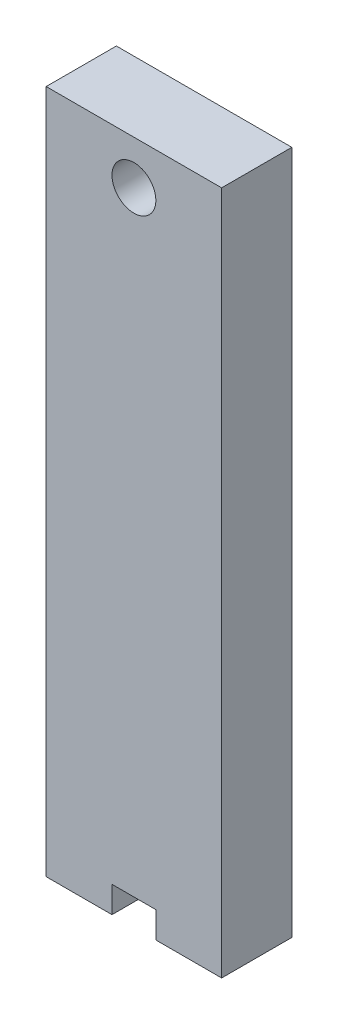
ISO-10303-21;
HEADER;
FILE_DESCRIPTION(('STEP AP214'),'2;1');
FILE_NAME('part.step','',(''),(''),'','','');
FILE_SCHEMA(('AUTOMOTIVE_DESIGN { 1 0 10303 214 1 1 1 1 }'));
ENDSEC;
DATA;
#1=APPLICATION_CONTEXT('core data for automotive mechanical design processes');
#2=APPLICATION_PROTOCOL_DEFINITION('international standard','automotive_design',2000,#1);
#3=PRODUCT_CONTEXT('',#1,'mechanical');
#4=PRODUCT('Part','Part','',(#3));
#5=PRODUCT_RELATED_PRODUCT_CATEGORY('part','',(#4));
#6=PRODUCT_DEFINITION_FORMATION('','',#4);
#7=PRODUCT_DEFINITION_CONTEXT('part definition',#1,'design');
#8=PRODUCT_DEFINITION('design','',#6,#7);
#9=PRODUCT_DEFINITION_SHAPE('','',#8);
#10=(LENGTH_UNIT() NAMED_UNIT(*) SI_UNIT(.MILLI.,.METRE.));
#11=(NAMED_UNIT(*) PLANE_ANGLE_UNIT() SI_UNIT($,.RADIAN.));
#12=(NAMED_UNIT(*) SI_UNIT($,.STERADIAN.) SOLID_ANGLE_UNIT());
#13=UNCERTAINTY_MEASURE_WITH_UNIT(LENGTH_MEASURE(1.E-05),#10,'distance_accuracy_value','');
#14=(GEOMETRIC_REPRESENTATION_CONTEXT(3) GLOBAL_UNCERTAINTY_ASSIGNED_CONTEXT((#13)) GLOBAL_UNIT_ASSIGNED_CONTEXT((#10,
#11,#12)) REPRESENTATION_CONTEXT('',''));
#15=CARTESIAN_POINT('',(0.,0.,0.));
#16=DIRECTION('',(0.,0.,1.));
#17=DIRECTION('',(1.,0.,0.));
#18=AXIS2_PLACEMENT_3D('',#15,#16,#17);
#19=CARTESIAN_POINT('',(0.,0.,0.));
#20=DIRECTION('',(0.,1.,0.));
#21=DIRECTION('',(0.,0.,1.));
#22=AXIS2_PLACEMENT_3D('',#19,#20,#21);
#23=PLANE('',#22);
#24=DIRECTION('',(0.,0.,-1.));
#25=VECTOR('',#24,1.);
#26=CARTESIAN_POINT('',(2.49999999999999,0.,-4.));
#27=LINE('',#26,#25);
#28=CARTESIAN_POINT('',(2.49999999999999,0.,4.));
#29=VERTEX_POINT('',#28);
#30=CARTESIAN_POINT('',(2.49999999999999,0.,2.));
#31=VERTEX_POINT('',#30);
#32=EDGE_CURVE('E53',#29,#31,#27,.T.);
#33=ORIENTED_EDGE('',*,*,#32,.F.);
#34=DIRECTION('',(1.,0.,0.));
#35=VECTOR('',#34,1.);
#36=CARTESIAN_POINT('',(-9.99999999999999,0.,4.));
#37=LINE('',#36,#35);
#38=CARTESIAN_POINT('',(-2.50000000000001,0.,4.));
#39=VERTEX_POINT('',#38);
#40=EDGE_CURVE('E318',#39,#29,#37,.T.);
#41=ORIENTED_EDGE('',*,*,#40,.F.);
#42=DIRECTION('',(0.,0.,1.));
#43=VECTOR('',#42,1.);
#44=CARTESIAN_POINT('',(-2.50000000000001,0.,4.));
#45=LINE('',#44,#43);
#46=CARTESIAN_POINT('',(-2.50000000000001,0.,2.));
#47=VERTEX_POINT('',#46);
#48=EDGE_CURVE('E11',#47,#39,#45,.T.);
#49=ORIENTED_EDGE('',*,*,#48,.F.);
#50=DIRECTION('',(1.,0.,0.));
#51=VECTOR('',#50,1.);
#52=CARTESIAN_POINT('',(-8.,0.,2.));
#53=LINE('',#52,#51);
#54=EDGE_CURVE('E301',#47,#31,#53,.T.);
#55=ORIENTED_EDGE('',*,*,#54,.T.);
#56=EDGE_LOOP('',(#33,#41,#49,#55));
#57=FACE_BOUND('',#56,.T.);
#58=ADVANCED_FACE('F36',(#57),#23,.F.);
#59=CARTESIAN_POINT('',(-8.,65.,-2.));
#60=DIRECTION('',(0.,0.,1.));
#61=DIRECTION('',(1.,0.,0.));
#62=AXIS2_PLACEMENT_3D('',#59,#60,#61);
#63=PLANE('',#62);
#64=DIRECTION('',(-1.,0.,0.));
#65=VECTOR('',#64,1.);
#66=CARTESIAN_POINT('',(8.,57.5,-2.));
#67=LINE('',#66,#65);
#68=CARTESIAN_POINT('',(8.,57.5,-2.));
#69=VERTEX_POINT('',#68);
#70=CARTESIAN_POINT('',(2.5,57.5,-2.));
#71=VERTEX_POINT('',#70);
#72=EDGE_CURVE('E238',#69,#71,#67,.T.);
#73=ORIENTED_EDGE('',*,*,#72,.T.);
#74=DIRECTION('',(0.,-1.,0.));
#75=VECTOR('',#74,1.);
#76=CARTESIAN_POINT('',(2.5,57.5,-2.));
#77=LINE('',#76,#75);
#78=CARTESIAN_POINT('',(2.49999999999999,0.,-2.));
#79=VERTEX_POINT('',#78);
#80=EDGE_CURVE('E271',#71,#79,#77,.T.);
#81=ORIENTED_EDGE('',*,*,#80,.T.);
#82=DIRECTION('',(-1.,0.,0.));
#83=VECTOR('',#82,1.);
#84=CARTESIAN_POINT('',(-8.,0.,-2.));
#85=LINE('',#84,#83);
#86=CARTESIAN_POINT('',(8.,0.,-2.));
#87=VERTEX_POINT('',#86);
#88=EDGE_CURVE('E295',#87,#79,#85,.T.);
#89=ORIENTED_EDGE('',*,*,#88,.F.);
#90=DIRECTION('',(0.,-1.,0.));
#91=VECTOR('',#90,1.);
#92=CARTESIAN_POINT('',(8.,65.,-2.));
#93=LINE('',#92,#91);
#94=EDGE_CURVE('E294',#69,#87,#93,.T.);
#95=ORIENTED_EDGE('',*,*,#94,.F.);
#96=EDGE_LOOP('',(#73,#81,#89,#95));
#97=FACE_BOUND('',#96,.T.);
#98=ADVANCED_FACE('F337',(#97),#63,.T.);
#99=DIRECTION('',(0.,1.,0.));
#100=VECTOR('',#99,1.);
#101=CARTESIAN_POINT('',(-2.5,57.5,-2.));
#102=LINE('',#101,#100);
#103=CARTESIAN_POINT('',(-2.50000000000001,0.,-2.));
#104=VERTEX_POINT('',#103);
#105=CARTESIAN_POINT('',(-2.5,57.5,-2.));
#106=VERTEX_POINT('',#105);
#107=EDGE_CURVE('E268',#104,#106,#102,.T.);
#108=ORIENTED_EDGE('',*,*,#107,.T.);
#109=DIRECTION('',(-1.,0.,0.));
#110=VECTOR('',#109,1.);
#111=CARTESIAN_POINT('',(-8.,57.5,-2.));
#112=LINE('',#111,#110);
#113=CARTESIAN_POINT('',(-8.,57.5,-2.));
#114=VERTEX_POINT('',#113);
#115=EDGE_CURVE('E263',#106,#114,#112,.T.);
#116=ORIENTED_EDGE('',*,*,#115,.T.);
#117=DIRECTION('',(0.,-1.,0.));
#118=VECTOR('',#117,1.);
#119=CARTESIAN_POINT('',(-8.,65.,-2.));
#120=LINE('',#119,#118);
#121=CARTESIAN_POINT('',(-8.,0.,-2.));
#122=VERTEX_POINT('',#121);
#123=EDGE_CURVE('E314',#114,#122,#120,.T.);
#124=ORIENTED_EDGE('',*,*,#123,.T.);
#125=EDGE_CURVE('E280',#104,#122,#85,.T.);
#126=ORIENTED_EDGE('',*,*,#125,.F.);
#127=EDGE_LOOP('',(#108,#116,#124,#126));
#128=FACE_BOUND('',#127,.T.);
#129=ADVANCED_FACE('F331',(#128),#63,.T.);
#130=CARTESIAN_POINT('',(10.,65.,-4.));
#131=DIRECTION('',(-1.,0.,0.));
#132=DIRECTION('',(0.,0.,1.));
#133=AXIS2_PLACEMENT_3D('',#130,#131,#132);
#134=PLANE('',#133);
#135=DIRECTION('',(0.,-1.,0.));
#136=VECTOR('',#135,1.);
#137=CARTESIAN_POINT('',(10.,65.,4.));
#138=LINE('',#137,#136);
#139=CARTESIAN_POINT('',(10.,75.,4.));
#140=VERTEX_POINT('',#139);
#141=CARTESIAN_POINT('',(10.,-3.,4.));
#142=VERTEX_POINT('',#141);
#143=EDGE_CURVE('E181',#140,#142,#138,.T.);
#144=ORIENTED_EDGE('',*,*,#143,.T.);
#145=DIRECTION('',(0.,0.,1.));
#146=VECTOR('',#145,1.);
#147=CARTESIAN_POINT('',(10.,-3.,-4.));
#148=LINE('',#147,#146);
#149=CARTESIAN_POINT('',(10.,-3.,-4.));
#150=VERTEX_POINT('',#149);
#151=EDGE_CURVE('E212',#150,#142,#148,.T.);
#152=ORIENTED_EDGE('',*,*,#151,.F.);
#153=DIRECTION('',(0.,-1.,0.));
#154=VECTOR('',#153,1.);
#155=CARTESIAN_POINT('',(10.,65.,-4.));
#156=LINE('',#155,#154);
#157=CARTESIAN_POINT('',(10.,75.,-4.));
#158=VERTEX_POINT('',#157);
#159=EDGE_CURVE('E40',#158,#150,#156,.T.);
#160=ORIENTED_EDGE('',*,*,#159,.F.);
#161=DIRECTION('',(0.,0.,-1.));
#162=VECTOR('',#161,1.);
#163=CARTESIAN_POINT('',(10.,75.,-4.));
#164=LINE('',#163,#162);
#165=EDGE_CURVE('E190',#140,#158,#164,.T.);
#166=ORIENTED_EDGE('',*,*,#165,.F.);
#167=EDGE_LOOP('',(#144,#152,#160,#166));
#168=FACE_BOUND('',#167,.T.);
#169=ADVANCED_FACE('F38',(#168),#134,.F.);
#170=CARTESIAN_POINT('',(-10.,65.,-4.));
#171=DIRECTION('',(0.,0.,1.));
#172=DIRECTION('',(1.,0.,0.));
#173=AXIS2_PLACEMENT_3D('',#170,#171,#172);
#174=PLANE('',#173);
#175=CARTESIAN_POINT('',(0.,70.,-4.));
#176=DIRECTION('',(0.,0.,1.));
#177=DIRECTION('',(1.,0.,0.));
#178=AXIS2_PLACEMENT_3D('',#175,#176,#177);
#179=CIRCLE('',#178,2.5);
#180=CARTESIAN_POINT('',(2.5,70.,-4.));
#181=VERTEX_POINT('',#180);
#182=EDGE_CURVE('E196',#181,#181,#179,.T.);
#183=ORIENTED_EDGE('',*,*,#182,.T.);
#184=EDGE_LOOP('',(#183));
#185=FACE_BOUND('',#184,.T.);
#186=ORIENTED_EDGE('',*,*,#159,.T.);
#187=DIRECTION('',(1.,0.,0.));
#188=VECTOR('',#187,1.);
#189=CARTESIAN_POINT('',(2.49999999999999,-3.,-4.));
#190=LINE('',#189,#188);
#191=CARTESIAN_POINT('',(2.49999999999999,-3.,-4.));
#192=VERTEX_POINT('',#191);
#193=EDGE_CURVE('E209',#192,#150,#190,.T.);
#194=ORIENTED_EDGE('',*,*,#193,.F.);
#195=DIRECTION('',(0.,-1.,0.));
#196=VECTOR('',#195,1.);
#197=CARTESIAN_POINT('',(2.5,57.5,-4.));
#198=LINE('',#197,#196);
#199=CARTESIAN_POINT('',(2.5,57.5,-4.));
#200=VERTEX_POINT('',#199);
#201=EDGE_CURVE('E248',#200,#192,#198,.T.);
#202=ORIENTED_EDGE('',*,*,#201,.F.);
#203=DIRECTION('',(-1.,0.,0.));
#204=VECTOR('',#203,1.);
#205=CARTESIAN_POINT('',(8.,57.5,-4.));
#206=LINE('',#205,#204);
#207=CARTESIAN_POINT('',(8.,57.5,-4.));
#208=VERTEX_POINT('',#207);
#209=EDGE_CURVE('E250',#208,#200,#206,.T.);
#210=ORIENTED_EDGE('',*,*,#209,.F.);
#211=DIRECTION('',(0.,-1.,0.));
#212=VECTOR('',#211,1.);
#213=CARTESIAN_POINT('',(8.,60.,-4.));
#214=LINE('',#213,#212);
#215=CARTESIAN_POINT('',(8.,60.,-4.));
#216=VERTEX_POINT('',#215);
#217=EDGE_CURVE('E234',#216,#208,#214,.T.);
#218=ORIENTED_EDGE('',*,*,#217,.F.);
#219=DIRECTION('',(1.,0.,0.));
#220=VECTOR('',#219,1.);
#221=CARTESIAN_POINT('',(-8.,60.,-4.));
#222=LINE('',#221,#220);
#223=CARTESIAN_POINT('',(-8.,60.,-4.));
#224=VERTEX_POINT('',#223);
#225=EDGE_CURVE('E235',#224,#216,#222,.T.);
#226=ORIENTED_EDGE('',*,*,#225,.F.);
#227=DIRECTION('',(0.,1.,0.));
#228=VECTOR('',#227,1.);
#229=CARTESIAN_POINT('',(-8.,60.,-4.));
#230=LINE('',#229,#228);
#231=CARTESIAN_POINT('',(-8.,57.5,-4.));
#232=VERTEX_POINT('',#231);
#233=EDGE_CURVE('E239',#232,#224,#230,.T.);
#234=ORIENTED_EDGE('',*,*,#233,.F.);
#235=DIRECTION('',(-1.,0.,0.));
#236=VECTOR('',#235,1.);
#237=CARTESIAN_POINT('',(-8.,57.5,-4.));
#238=LINE('',#237,#236);
#239=CARTESIAN_POINT('',(-2.5,57.5,-4.));
#240=VERTEX_POINT('',#239);
#241=EDGE_CURVE('E242',#240,#232,#238,.T.);
#242=ORIENTED_EDGE('',*,*,#241,.F.);
#243=DIRECTION('',(0.,1.,0.));
#244=VECTOR('',#243,1.);
#245=CARTESIAN_POINT('',(-2.5,57.5,-4.));
#246=LINE('',#245,#244);
#247=CARTESIAN_POINT('',(-2.50000000000001,-3.,-4.));
#248=VERTEX_POINT('',#247);
#249=EDGE_CURVE('E245',#248,#240,#246,.T.);
#250=ORIENTED_EDGE('',*,*,#249,.F.);
#251=DIRECTION('',(1.,0.,0.));
#252=VECTOR('',#251,1.);
#253=CARTESIAN_POINT('',(-9.99999999999999,-3.,-4.));
#254=LINE('',#253,#252);
#255=CARTESIAN_POINT('',(-9.99999999999999,-3.,-4.));
#256=VERTEX_POINT('',#255);
#257=EDGE_CURVE('E223',#256,#248,#254,.T.);
#258=ORIENTED_EDGE('',*,*,#257,.F.);
#259=DIRECTION('',(0.,-1.,0.));
#260=VECTOR('',#259,1.);
#261=CARTESIAN_POINT('',(-10.,65.,-4.));
#262=LINE('',#261,#260);
#263=CARTESIAN_POINT('',(-10.,75.,-4.));
#264=VERTEX_POINT('',#263);
#265=EDGE_CURVE('E180',#264,#256,#262,.T.);
#266=ORIENTED_EDGE('',*,*,#265,.F.);
#267=DIRECTION('',(-1.,0.,0.));
#268=VECTOR('',#267,1.);
#269=CARTESIAN_POINT('',(-10.,75.,-4.));
#270=LINE('',#269,#268);
#271=EDGE_CURVE('E195',#158,#264,#270,.T.);
#272=ORIENTED_EDGE('',*,*,#271,.F.);
#273=EDGE_LOOP('',(#186,#194,#202,#210,#218,#226,#234,#242,#250,#258,#266,#272));
#274=FACE_BOUND('',#273,.T.);
#275=ADVANCED_FACE('F323',(#185,#274),#174,.F.);
#276=CARTESIAN_POINT('',(-10.,65.,-4.));
#277=DIRECTION('',(1.,0.,0.));
#278=DIRECTION('',(0.,0.,-1.));
#279=AXIS2_PLACEMENT_3D('',#276,#277,#278);
#280=PLANE('',#279);
#281=ORIENTED_EDGE('',*,*,#265,.T.);
#282=DIRECTION('',(0.,0.,-1.));
#283=VECTOR('',#282,1.);
#284=CARTESIAN_POINT('',(-9.99999999999999,-3.,4.));
#285=LINE('',#284,#283);
#286=CARTESIAN_POINT('',(-9.99999999999999,-3.,4.));
#287=VERTEX_POINT('',#286);
#288=EDGE_CURVE('E176',#287,#256,#285,.T.);
#289=ORIENTED_EDGE('',*,*,#288,.F.);
#290=DIRECTION('',(0.,-1.,0.));
#291=VECTOR('',#290,1.);
#292=CARTESIAN_POINT('',(-9.99999999999999,65.,4.));
#293=LINE('',#292,#291);
#294=CARTESIAN_POINT('',(-10.,75.,4.));
#295=VERTEX_POINT('',#294);
#296=EDGE_CURVE('E170',#295,#287,#293,.T.);
#297=ORIENTED_EDGE('',*,*,#296,.F.);
#298=DIRECTION('',(0.,0.,1.));
#299=VECTOR('',#298,1.);
#300=CARTESIAN_POINT('',(-10.,75.,-4.));
#301=LINE('',#300,#299);
#302=EDGE_CURVE('E174',#264,#295,#301,.T.);
#303=ORIENTED_EDGE('',*,*,#302,.F.);
#304=EDGE_LOOP('',(#281,#289,#297,#303));
#305=FACE_BOUND('',#304,.T.);
#306=ADVANCED_FACE('F172',(#305),#280,.F.);
#307=CARTESIAN_POINT('',(-9.99999999999999,65.,4.));
#308=DIRECTION('',(0.,0.,-1.));
#309=DIRECTION('',(-1.,0.,0.));
#310=AXIS2_PLACEMENT_3D('',#307,#308,#309);
#311=PLANE('',#310);
#312=CARTESIAN_POINT('',(0.,70.,4.));
#313=DIRECTION('',(0.,0.,-1.));
#314=DIRECTION('',(-1.,0.,0.));
#315=AXIS2_PLACEMENT_3D('',#312,#313,#314);
#316=CIRCLE('',#315,2.5);
#317=CARTESIAN_POINT('',(-2.5,70.,4.));
#318=VERTEX_POINT('',#317);
#319=EDGE_CURVE('E199',#318,#318,#316,.T.);
#320=ORIENTED_EDGE('',*,*,#319,.T.);
#321=EDGE_LOOP('',(#320));
#322=FACE_BOUND('',#321,.T.);
#323=ORIENTED_EDGE('',*,*,#296,.T.);
#324=DIRECTION('',(-1.,0.,0.));
#325=VECTOR('',#324,1.);
#326=CARTESIAN_POINT('',(-9.99999999999999,-3.,4.));
#327=LINE('',#326,#325);
#328=CARTESIAN_POINT('',(-2.50000000000001,-3.,4.));
#329=VERTEX_POINT('',#328);
#330=EDGE_CURVE('E228',#329,#287,#327,.T.);
#331=ORIENTED_EDGE('',*,*,#330,.F.);
#332=DIRECTION('',(0.,1.,0.));
#333=VECTOR('',#332,1.);
#334=CARTESIAN_POINT('',(-2.50000000000001,-3.,4.));
#335=LINE('',#334,#333);
#336=EDGE_CURVE('E229',#329,#39,#335,.T.);
#337=ORIENTED_EDGE('',*,*,#336,.T.);
#338=ORIENTED_EDGE('',*,*,#40,.T.);
#339=DIRECTION('',(0.,1.,0.));
#340=VECTOR('',#339,1.);
#341=CARTESIAN_POINT('',(2.49999999999999,-3.,4.));
#342=LINE('',#341,#340);
#343=CARTESIAN_POINT('',(2.49999999999999,-3.,4.));
#344=VERTEX_POINT('',#343);
#345=EDGE_CURVE('E217',#344,#29,#342,.T.);
#346=ORIENTED_EDGE('',*,*,#345,.F.);
#347=DIRECTION('',(-1.,0.,0.));
#348=VECTOR('',#347,1.);
#349=CARTESIAN_POINT('',(2.49999999999999,-3.,4.));
#350=LINE('',#349,#348);
#351=EDGE_CURVE('E215',#142,#344,#350,.T.);
#352=ORIENTED_EDGE('',*,*,#351,.F.);
#353=ORIENTED_EDGE('',*,*,#143,.F.);
#354=DIRECTION('',(1.,0.,0.));
#355=VECTOR('',#354,1.);
#356=CARTESIAN_POINT('',(-10.,75.,4.));
#357=LINE('',#356,#355);
#358=EDGE_CURVE('E184',#295,#140,#357,.T.);
#359=ORIENTED_EDGE('',*,*,#358,.F.);
#360=EDGE_LOOP('',(#323,#331,#337,#338,#346,#352,#353,#359));
#361=FACE_BOUND('',#360,.T.);
#362=ADVANCED_FACE('F185',(#322,#361),#311,.F.);
#363=DIRECTION('',(1.,0.,0.));
#364=VECTOR('',#363,1.);
#365=CARTESIAN_POINT('',(-8.,60.,-2.));
#366=LINE('',#365,#364);
#367=CARTESIAN_POINT('',(-8.,60.,-2.));
#368=VERTEX_POINT('',#367);
#369=CARTESIAN_POINT('',(8.,60.,-2.));
#370=VERTEX_POINT('',#369);
#371=EDGE_CURVE('E258',#368,#370,#366,.T.);
#372=ORIENTED_EDGE('',*,*,#371,.T.);
#373=CARTESIAN_POINT('',(8.,65.,-2.));
#374=VERTEX_POINT('',#373);
#375=EDGE_CURVE('E307',#374,#370,#93,.T.);
#376=ORIENTED_EDGE('',*,*,#375,.F.);
#377=DIRECTION('',(-1.,0.,0.));
#378=VECTOR('',#377,1.);
#379=CARTESIAN_POINT('',(-8.,65.,-2.));
#380=LINE('',#379,#378);
#381=CARTESIAN_POINT('',(-8.,65.,-2.));
#382=VERTEX_POINT('',#381);
#383=EDGE_CURVE('E281',#374,#382,#380,.T.);
#384=ORIENTED_EDGE('',*,*,#383,.T.);
#385=EDGE_CURVE('E315',#382,#368,#120,.T.);
#386=ORIENTED_EDGE('',*,*,#385,.T.);
#387=EDGE_LOOP('',(#372,#376,#384,#386));
#388=FACE_BOUND('',#387,.T.);
#389=ADVANCED_FACE('F340',(#388),#63,.T.);
#390=CARTESIAN_POINT('',(-8.,65.,-2.));
#391=DIRECTION('',(1.,0.,0.));
#392=DIRECTION('',(0.,0.,-1.));
#393=AXIS2_PLACEMENT_3D('',#390,#391,#392);
#394=PLANE('',#393);
#395=DIRECTION('',(0.,0.,1.));
#396=VECTOR('',#395,1.);
#397=CARTESIAN_POINT('',(-8.,0.,-2.));
#398=LINE('',#397,#396);
#399=CARTESIAN_POINT('',(-8.,0.,2.));
#400=VERTEX_POINT('',#399);
#401=EDGE_CURVE('E298',#122,#400,#398,.T.);
#402=ORIENTED_EDGE('',*,*,#401,.F.);
#403=ORIENTED_EDGE('',*,*,#123,.F.);
#404=DIRECTION('',(0.,0.,-1.));
#405=VECTOR('',#404,1.);
#406=CARTESIAN_POINT('',(-8.,57.5,60.0966987850401));
#407=LINE('',#406,#405);
#408=EDGE_CURVE('E266',#114,#232,#407,.T.);
#409=ORIENTED_EDGE('',*,*,#408,.T.);
#410=ORIENTED_EDGE('',*,*,#233,.T.);
#411=DIRECTION('',(0.,0.,-1.));
#412=VECTOR('',#411,1.);
#413=CARTESIAN_POINT('',(-8.,60.,60.0966987850401));
#414=LINE('',#413,#412);
#415=EDGE_CURVE('E262',#368,#224,#414,.T.);
#416=ORIENTED_EDGE('',*,*,#415,.F.);
#417=ORIENTED_EDGE('',*,*,#385,.F.);
#418=DIRECTION('',(0.,0.,1.));
#419=VECTOR('',#418,1.);
#420=CARTESIAN_POINT('',(-8.,65.,-2.));
#421=LINE('',#420,#419);
#422=CARTESIAN_POINT('',(-8.,65.,2.));
#423=VERTEX_POINT('',#422);
#424=EDGE_CURVE('E284',#382,#423,#421,.T.);
#425=ORIENTED_EDGE('',*,*,#424,.T.);
#426=DIRECTION('',(0.,-1.,0.));
#427=VECTOR('',#426,1.);
#428=CARTESIAN_POINT('',(-8.,65.,2.));
#429=LINE('',#428,#427);
#430=EDGE_CURVE('E312',#423,#400,#429,.T.);
#431=ORIENTED_EDGE('',*,*,#430,.T.);
#432=EDGE_LOOP('',(#402,#403,#409,#410,#416,#417,#425,#431));
#433=FACE_BOUND('',#432,.T.);
#434=ADVANCED_FACE('F368',(#433),#394,.T.);
#435=CARTESIAN_POINT('',(-8.,65.,2.));
#436=DIRECTION('',(0.,0.,-1.));
#437=DIRECTION('',(-1.,0.,0.));
#438=AXIS2_PLACEMENT_3D('',#435,#436,#437);
#439=PLANE('',#438);
#440=EDGE_CURVE('E302',#400,#47,#53,.T.);
#441=ORIENTED_EDGE('',*,*,#440,.F.);
#442=ORIENTED_EDGE('',*,*,#430,.F.);
#443=DIRECTION('',(1.,0.,0.));
#444=VECTOR('',#443,1.);
#445=CARTESIAN_POINT('',(-8.,65.,2.));
#446=LINE('',#445,#444);
#447=CARTESIAN_POINT('',(8.,65.,2.));
#448=VERTEX_POINT('',#447);
#449=EDGE_CURVE('E288',#423,#448,#446,.T.);
#450=ORIENTED_EDGE('',*,*,#449,.T.);
#451=DIRECTION('',(0.,-1.,0.));
#452=VECTOR('',#451,1.);
#453=CARTESIAN_POINT('',(8.,65.,2.));
#454=LINE('',#453,#452);
#455=CARTESIAN_POINT('',(8.,0.,2.));
#456=VERTEX_POINT('',#455);
#457=EDGE_CURVE('E310',#448,#456,#454,.T.);
#458=ORIENTED_EDGE('',*,*,#457,.T.);
#459=DIRECTION('',(1.,0.,0.));
#460=VECTOR('',#459,1.);
#461=CARTESIAN_POINT('',(-8.,0.,2.));
#462=LINE('',#461,#460);
#463=EDGE_CURVE('E61',#31,#456,#462,.T.);
#464=ORIENTED_EDGE('',*,*,#463,.F.);
#465=ORIENTED_EDGE('',*,*,#54,.F.);
#466=EDGE_LOOP('',(#441,#442,#450,#458,#464,#465));
#467=FACE_BOUND('',#466,.T.);
#468=ADVANCED_FACE('F375',(#467),#439,.T.);
#469=CARTESIAN_POINT('',(8.,65.,-2.));
#470=DIRECTION('',(-1.,0.,0.));
#471=DIRECTION('',(0.,0.,1.));
#472=AXIS2_PLACEMENT_3D('',#469,#470,#471);
#473=PLANE('',#472);
#474=DIRECTION('',(0.,0.,-1.));
#475=VECTOR('',#474,1.);
#476=CARTESIAN_POINT('',(8.,0.,-2.));
#477=LINE('',#476,#475);
#478=EDGE_CURVE('E285',#456,#87,#477,.T.);
#479=ORIENTED_EDGE('',*,*,#478,.F.);
#480=ORIENTED_EDGE('',*,*,#457,.F.);
#481=DIRECTION('',(0.,0.,-1.));
#482=VECTOR('',#481,1.);
#483=CARTESIAN_POINT('',(8.,65.,-2.));
#484=LINE('',#483,#482);
#485=EDGE_CURVE('E291',#448,#374,#484,.T.);
#486=ORIENTED_EDGE('',*,*,#485,.T.);
#487=ORIENTED_EDGE('',*,*,#375,.T.);
#488=DIRECTION('',(0.,0.,-1.));
#489=VECTOR('',#488,1.);
#490=CARTESIAN_POINT('',(8.,60.,60.0966987850401));
#491=LINE('',#490,#489);
#492=EDGE_CURVE('E261',#370,#216,#491,.T.);
#493=ORIENTED_EDGE('',*,*,#492,.T.);
#494=ORIENTED_EDGE('',*,*,#217,.T.);
#495=DIRECTION('',(0.,0.,-1.));
#496=VECTOR('',#495,1.);
#497=CARTESIAN_POINT('',(8.,57.5,60.0966987850401));
#498=LINE('',#497,#496);
#499=EDGE_CURVE('E274',#69,#208,#498,.T.);
#500=ORIENTED_EDGE('',*,*,#499,.F.);
#501=ORIENTED_EDGE('',*,*,#94,.T.);
#502=EDGE_LOOP('',(#479,#480,#486,#487,#493,#494,#500,#501));
#503=FACE_BOUND('',#502,.T.);
#504=ADVANCED_FACE('F382',(#503),#473,.T.);
#505=CARTESIAN_POINT('',(8.,57.5,60.0966987850401));
#506=DIRECTION('',(0.,-1.,0.));
#507=DIRECTION('',(0.,0.,-1.));
#508=AXIS2_PLACEMENT_3D('',#505,#506,#507);
#509=PLANE('',#508);
#510=ORIENTED_EDGE('',*,*,#499,.T.);
#511=ORIENTED_EDGE('',*,*,#209,.T.);
#512=DIRECTION('',(0.,0.,-1.));
#513=VECTOR('',#512,1.);
#514=CARTESIAN_POINT('',(2.5,57.5,60.0966987850401));
#515=LINE('',#514,#513);
#516=EDGE_CURVE('E257',#71,#200,#515,.T.);
#517=ORIENTED_EDGE('',*,*,#516,.F.);
#518=ORIENTED_EDGE('',*,*,#72,.F.);
#519=EDGE_LOOP('',(#510,#511,#517,#518));
#520=FACE_BOUND('',#519,.T.);
#521=ADVANCED_FACE('F389',(#520),#509,.F.);
#522=CARTESIAN_POINT('',(2.5,57.5,60.0966987850401));
#523=DIRECTION('',(1.,0.,0.));
#524=DIRECTION('',(0.,1.,0.));
#525=AXIS2_PLACEMENT_3D('',#522,#523,#524);
#526=PLANE('',#525);
#527=ORIENTED_EDGE('',*,*,#516,.T.);
#528=ORIENTED_EDGE('',*,*,#201,.T.);
#529=DIRECTION('',(0.,0.,-1.));
#530=VECTOR('',#529,1.);
#531=CARTESIAN_POINT('',(2.49999999999999,-3.,-4.));
#532=LINE('',#531,#530);
#533=EDGE_CURVE('E206',#344,#192,#532,.T.);
#534=ORIENTED_EDGE('',*,*,#533,.F.);
#535=ORIENTED_EDGE('',*,*,#345,.T.);
#536=ORIENTED_EDGE('',*,*,#32,.T.);
#537=EDGE_CURVE('E205',#31,#79,#27,.T.);
#538=ORIENTED_EDGE('',*,*,#537,.T.);
#539=ORIENTED_EDGE('',*,*,#80,.F.);
#540=EDGE_LOOP('',(#527,#528,#534,#535,#536,#538,#539));
#541=FACE_BOUND('',#540,.T.);
#542=ADVANCED_FACE('F398',(#541),#526,.F.);
#543=CARTESIAN_POINT('',(-2.5,57.5,60.0966987850401));
#544=DIRECTION('',(-1.,0.,0.));
#545=DIRECTION('',(0.,-1.,0.));
#546=AXIS2_PLACEMENT_3D('',#543,#544,#545);
#547=PLANE('',#546);
#548=ORIENTED_EDGE('',*,*,#107,.F.);
#549=EDGE_CURVE('E46',#104,#47,#45,.T.);
#550=ORIENTED_EDGE('',*,*,#549,.T.);
#551=ORIENTED_EDGE('',*,*,#48,.T.);
#552=ORIENTED_EDGE('',*,*,#336,.F.);
#553=DIRECTION('',(0.,0.,1.));
#554=VECTOR('',#553,1.);
#555=CARTESIAN_POINT('',(-2.50000000000001,-3.,4.));
#556=LINE('',#555,#554);
#557=EDGE_CURVE('E226',#248,#329,#556,.T.);
#558=ORIENTED_EDGE('',*,*,#557,.F.);
#559=ORIENTED_EDGE('',*,*,#249,.T.);
#560=DIRECTION('',(0.,0.,-1.));
#561=VECTOR('',#560,1.);
#562=CARTESIAN_POINT('',(-2.5,57.5,60.0966987850401));
#563=LINE('',#562,#561);
#564=EDGE_CURVE('E267',#106,#240,#563,.T.);
#565=ORIENTED_EDGE('',*,*,#564,.F.);
#566=EDGE_LOOP('',(#548,#550,#551,#552,#558,#559,#565));
#567=FACE_BOUND('',#566,.T.);
#568=ADVANCED_FACE('F407',(#567),#547,.F.);
#569=CARTESIAN_POINT('',(-8.,57.5,60.0966987850401));
#570=DIRECTION('',(0.,-1.,0.));
#571=DIRECTION('',(0.,0.,-1.));
#572=AXIS2_PLACEMENT_3D('',#569,#570,#571);
#573=PLANE('',#572);
#574=ORIENTED_EDGE('',*,*,#564,.T.);
#575=ORIENTED_EDGE('',*,*,#241,.T.);
#576=ORIENTED_EDGE('',*,*,#408,.F.);
#577=ORIENTED_EDGE('',*,*,#115,.F.);
#578=EDGE_LOOP('',(#574,#575,#576,#577));
#579=FACE_BOUND('',#578,.T.);
#580=ADVANCED_FACE('F416',(#579),#573,.F.);
#581=CARTESIAN_POINT('',(-8.,60.,60.0966987850401));
#582=DIRECTION('',(0.,1.,0.));
#583=DIRECTION('',(0.,0.,1.));
#584=AXIS2_PLACEMENT_3D('',#581,#582,#583);
#585=PLANE('',#584);
#586=ORIENTED_EDGE('',*,*,#415,.T.);
#587=ORIENTED_EDGE('',*,*,#225,.T.);
#588=ORIENTED_EDGE('',*,*,#492,.F.);
#589=ORIENTED_EDGE('',*,*,#371,.F.);
#590=EDGE_LOOP('',(#586,#587,#588,#589));
#591=FACE_BOUND('',#590,.T.);
#592=ADVANCED_FACE('F424',(#591),#585,.F.);
#593=CARTESIAN_POINT('',(0.,0.,0.));
#594=DIRECTION('',(0.,-1.,0.));
#595=DIRECTION('',(0.,0.,-1.));
#596=AXIS2_PLACEMENT_3D('',#593,#594,#595);
#597=PLANE('',#596);
#598=ORIENTED_EDGE('',*,*,#549,.F.);
#599=ORIENTED_EDGE('',*,*,#125,.T.);
#600=ORIENTED_EDGE('',*,*,#401,.T.);
#601=ORIENTED_EDGE('',*,*,#440,.T.);
#602=EDGE_LOOP('',(#598,#599,#600,#601));
#603=FACE_BOUND('',#602,.T.);
#604=ADVANCED_FACE('F432',(#603),#597,.F.);
#605=CARTESIAN_POINT('',(0.,-3.,0.));
#606=DIRECTION('',(0.,-1.,0.));
#607=DIRECTION('',(0.,0.,-1.));
#608=AXIS2_PLACEMENT_3D('',#605,#606,#607);
#609=PLANE('',#608);
#610=ORIENTED_EDGE('',*,*,#288,.T.);
#611=ORIENTED_EDGE('',*,*,#257,.T.);
#612=ORIENTED_EDGE('',*,*,#557,.T.);
#613=ORIENTED_EDGE('',*,*,#330,.T.);
#614=EDGE_LOOP('',(#610,#611,#612,#613));
#615=FACE_BOUND('',#614,.T.);
#616=ADVANCED_FACE('F439',(#615),#609,.T.);
#617=CARTESIAN_POINT('',(0.,-3.,0.));
#618=DIRECTION('',(0.,1.,0.));
#619=DIRECTION('',(0.,0.,1.));
#620=AXIS2_PLACEMENT_3D('',#617,#618,#619);
#621=PLANE('',#620);
#622=ORIENTED_EDGE('',*,*,#533,.T.);
#623=ORIENTED_EDGE('',*,*,#193,.T.);
#624=ORIENTED_EDGE('',*,*,#151,.T.);
#625=ORIENTED_EDGE('',*,*,#351,.T.);
#626=EDGE_LOOP('',(#622,#623,#624,#625));
#627=FACE_BOUND('',#626,.T.);
#628=ADVANCED_FACE('F328',(#627),#621,.F.);
#629=CARTESIAN_POINT('',(0.,0.,0.));
#630=DIRECTION('',(0.,1.,0.));
#631=DIRECTION('',(0.,0.,1.));
#632=AXIS2_PLACEMENT_3D('',#629,#630,#631);
#633=PLANE('',#632);
#634=ORIENTED_EDGE('',*,*,#478,.T.);
#635=ORIENTED_EDGE('',*,*,#88,.T.);
#636=ORIENTED_EDGE('',*,*,#537,.F.);
#637=ORIENTED_EDGE('',*,*,#463,.T.);
#638=EDGE_LOOP('',(#634,#635,#636,#637));
#639=FACE_BOUND('',#638,.T.);
#640=ADVANCED_FACE('F454',(#639),#633,.T.);
#641=CARTESIAN_POINT('',(0.,65.,0.));
#642=DIRECTION('',(0.,1.,0.));
#643=DIRECTION('',(0.,0.,1.));
#644=AXIS2_PLACEMENT_3D('',#641,#642,#643);
#645=PLANE('',#644);
#646=ORIENTED_EDGE('',*,*,#424,.F.);
#647=ORIENTED_EDGE('',*,*,#383,.F.);
#648=ORIENTED_EDGE('',*,*,#485,.F.);
#649=ORIENTED_EDGE('',*,*,#449,.F.);
#650=EDGE_LOOP('',(#646,#647,#648,#649));
#651=FACE_BOUND('',#650,.T.);
#652=ADVANCED_FACE('F461',(#651),#645,.F.);
#653=CARTESIAN_POINT('',(0.,75.,0.));
#654=DIRECTION('',(0.,1.,0.));
#655=DIRECTION('',(0.,0.,1.));
#656=AXIS2_PLACEMENT_3D('',#653,#654,#655);
#657=PLANE('',#656);
#658=ORIENTED_EDGE('',*,*,#302,.T.);
#659=ORIENTED_EDGE('',*,*,#358,.T.);
#660=ORIENTED_EDGE('',*,*,#165,.T.);
#661=ORIENTED_EDGE('',*,*,#271,.T.);
#662=EDGE_LOOP('',(#658,#659,#660,#661));
#663=FACE_BOUND('',#662,.T.);
#664=ADVANCED_FACE('F193',(#663),#657,.T.);
#665=CARTESIAN_POINT('',(0.,70.,4.));
#666=DIRECTION('',(0.,0.,-1.));
#667=DIRECTION('',(-1.,0.,0.));
#668=AXIS2_PLACEMENT_3D('',#665,#666,#667);
#669=CYLINDRICAL_SURFACE('',#668,2.5);
#670=ORIENTED_EDGE('',*,*,#319,.F.);
#671=EDGE_LOOP('',(#670));
#672=FACE_BOUND('',#671,.T.);
#673=ORIENTED_EDGE('',*,*,#182,.F.);
#674=EDGE_LOOP('',(#673));
#675=FACE_BOUND('',#674,.T.);
#676=ADVANCED_FACE('F475',(#672,#675),#669,.F.);
#677=CLOSED_SHELL('',(#58,#98,#129,#169,#275,#306,#362,#389,#434,#468,#504,#521,#542,#568,#580,
#592,#604,#616,#628,#640,#652,#664,#676));
#678=MANIFOLD_SOLID_BREP('B2',#677);
#679=ADVANCED_BREP_SHAPE_REPRESENTATION('',(#18,#678),#14);
#680=SHAPE_DEFINITION_REPRESENTATION(#9,#679);
ENDSEC;
END-ISO-10303-21;
